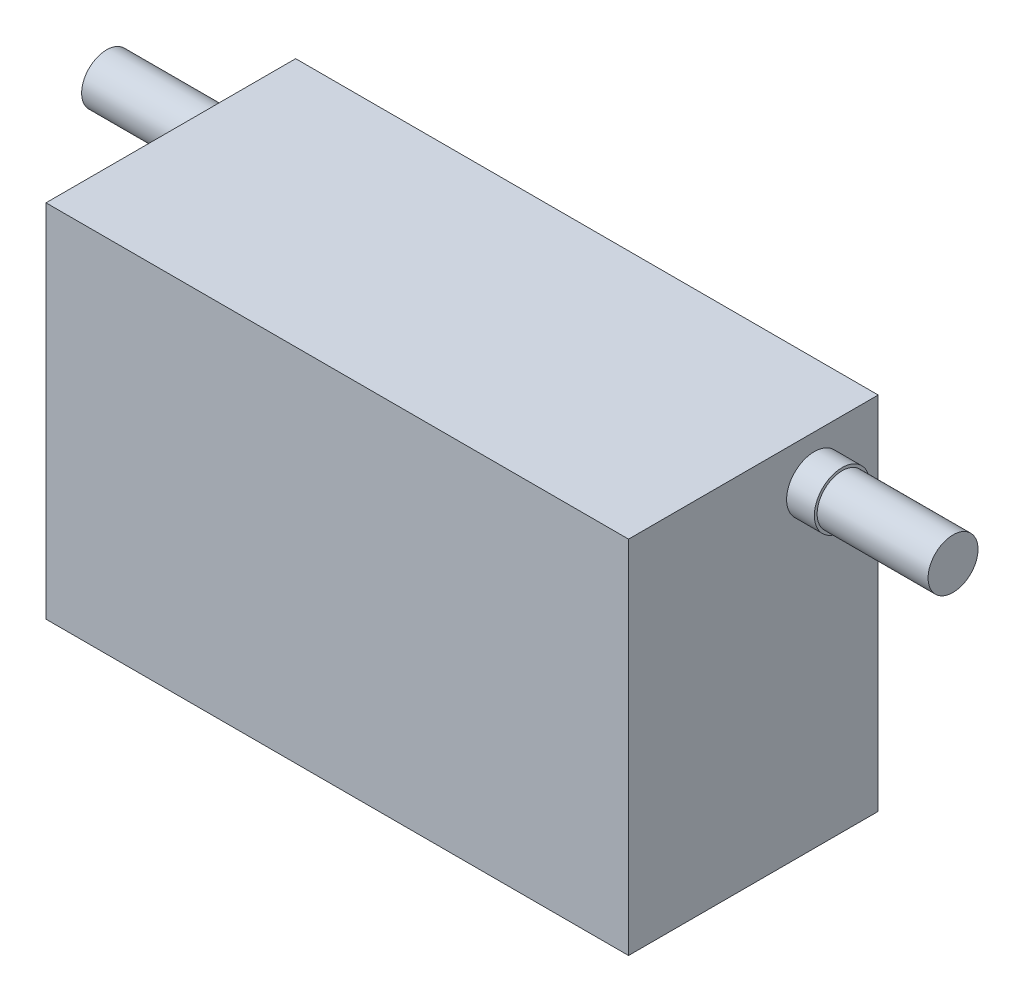
ISO-10303-21;
HEADER;
FILE_DESCRIPTION(('STEP AP214'),'2;1');
FILE_NAME('part.step','',(''),(''),'','','');
FILE_SCHEMA(('AUTOMOTIVE_DESIGN { 1 0 10303 214 1 1 1 1 }'));
ENDSEC;
DATA;
#1=APPLICATION_CONTEXT('core data for automotive mechanical design processes');
#2=APPLICATION_PROTOCOL_DEFINITION('international standard','automotive_design',2000,#1);
#3=PRODUCT_CONTEXT('',#1,'mechanical');
#4=PRODUCT('Part','Part','',(#3));
#5=PRODUCT_RELATED_PRODUCT_CATEGORY('part','',(#4));
#6=PRODUCT_DEFINITION_FORMATION('','',#4);
#7=PRODUCT_DEFINITION_CONTEXT('part definition',#1,'design');
#8=PRODUCT_DEFINITION('design','',#6,#7);
#9=PRODUCT_DEFINITION_SHAPE('','',#8);
#10=(LENGTH_UNIT() NAMED_UNIT(*) SI_UNIT(.MILLI.,.METRE.));
#11=(NAMED_UNIT(*) PLANE_ANGLE_UNIT() SI_UNIT($,.RADIAN.));
#12=(NAMED_UNIT(*) SI_UNIT($,.STERADIAN.) SOLID_ANGLE_UNIT());
#13=UNCERTAINTY_MEASURE_WITH_UNIT(LENGTH_MEASURE(1.E-05),#10,'distance_accuracy_value','');
#14=(GEOMETRIC_REPRESENTATION_CONTEXT(3) GLOBAL_UNCERTAINTY_ASSIGNED_CONTEXT((#13)) GLOBAL_UNIT_ASSIGNED_CONTEXT((#10,
#11,#12)) REPRESENTATION_CONTEXT('',''));
#15=CARTESIAN_POINT('',(0.,0.,0.));
#16=DIRECTION('',(0.,0.,1.));
#17=DIRECTION('',(1.,0.,0.));
#18=AXIS2_PLACEMENT_3D('',#15,#16,#17);
#19=CARTESIAN_POINT('',(-52.5,-32.5,45.));
#20=DIRECTION('',(1.,0.,0.));
#21=DIRECTION('',(0.,0.,-1.));
#22=AXIS2_PLACEMENT_3D('',#19,#20,#21);
#23=PLANE('',#22);
#24=CARTESIAN_POINT('',(-52.5,21.4211328330691,9.08049180265635));
#25=DIRECTION('',(1.,0.,0.));
#26=DIRECTION('',(0.,0.,-1.));
#27=AXIS2_PLACEMENT_3D('',#24,#25,#26);
#28=CIRCLE('',#27,5.);
#29=CARTESIAN_POINT('',(-52.5,21.4211328330691,4.08049180265635));
#30=VERTEX_POINT('',#29);
#31=EDGE_CURVE('E43',#30,#30,#28,.F.);
#32=ORIENTED_EDGE('',*,*,#31,.F.);
#33=EDGE_LOOP('',(#32));
#34=FACE_BOUND('',#33,.T.);
#35=DIRECTION('',(0.,-1.,0.));
#36=VECTOR('',#35,1.);
#37=CARTESIAN_POINT('',(-52.5,-32.5,0.));
#38=LINE('',#37,#36);
#39=CARTESIAN_POINT('',(-52.5,32.5,0.));
#40=VERTEX_POINT('',#39);
#41=CARTESIAN_POINT('',(-52.5,-32.5,0.));
#42=VERTEX_POINT('',#41);
#43=EDGE_CURVE('E102',#40,#42,#38,.T.);
#44=ORIENTED_EDGE('',*,*,#43,.T.);
#45=DIRECTION('',(0.,0.,-1.));
#46=VECTOR('',#45,1.);
#47=CARTESIAN_POINT('',(-52.5,-32.5,45.));
#48=LINE('',#47,#46);
#49=CARTESIAN_POINT('',(-52.5,-32.5,45.));
#50=VERTEX_POINT('',#49);
#51=EDGE_CURVE('E93',#50,#42,#48,.T.);
#52=ORIENTED_EDGE('',*,*,#51,.F.);
#53=DIRECTION('',(0.,-1.,0.));
#54=VECTOR('',#53,1.);
#55=CARTESIAN_POINT('',(-52.5,-32.5,45.));
#56=LINE('',#55,#54);
#57=CARTESIAN_POINT('',(-52.5,32.5,45.));
#58=VERTEX_POINT('',#57);
#59=EDGE_CURVE('E87',#58,#50,#56,.T.);
#60=ORIENTED_EDGE('',*,*,#59,.F.);
#61=DIRECTION('',(0.,0.,-1.));
#62=VECTOR('',#61,1.);
#63=CARTESIAN_POINT('',(-52.5,32.5,45.));
#64=LINE('',#63,#62);
#65=EDGE_CURVE('E98',#58,#40,#64,.T.);
#66=ORIENTED_EDGE('',*,*,#65,.T.);
#67=EDGE_LOOP('',(#44,#52,#60,#66));
#68=FACE_BOUND('',#67,.T.);
#69=ADVANCED_FACE('F35',(#34,#68),#23,.F.);
#70=CARTESIAN_POINT('',(52.5,-32.5,45.));
#71=DIRECTION('',(0.,1.,0.));
#72=DIRECTION('',(-1.,0.,0.));
#73=AXIS2_PLACEMENT_3D('',#70,#71,#72);
#74=PLANE('',#73);
#75=DIRECTION('',(1.,0.,0.));
#76=VECTOR('',#75,1.);
#77=CARTESIAN_POINT('',(52.5,-32.5,0.));
#78=LINE('',#77,#76);
#79=CARTESIAN_POINT('',(52.5,-32.5,0.));
#80=VERTEX_POINT('',#79);
#81=EDGE_CURVE('E92',#42,#80,#78,.T.);
#82=ORIENTED_EDGE('',*,*,#81,.T.);
#83=DIRECTION('',(0.,0.,-1.));
#84=VECTOR('',#83,1.);
#85=CARTESIAN_POINT('',(52.5,-32.5,45.));
#86=LINE('',#85,#84);
#87=CARTESIAN_POINT('',(52.5,-32.5,45.));
#88=VERTEX_POINT('',#87);
#89=EDGE_CURVE('E90',#88,#80,#86,.T.);
#90=ORIENTED_EDGE('',*,*,#89,.F.);
#91=DIRECTION('',(1.,0.,0.));
#92=VECTOR('',#91,1.);
#93=CARTESIAN_POINT('',(52.5,-32.5,45.));
#94=LINE('',#93,#92);
#95=EDGE_CURVE('E82',#50,#88,#94,.T.);
#96=ORIENTED_EDGE('',*,*,#95,.F.);
#97=ORIENTED_EDGE('',*,*,#51,.T.);
#98=EDGE_LOOP('',(#82,#90,#96,#97));
#99=FACE_BOUND('',#98,.T.);
#100=ADVANCED_FACE('F91',(#99),#74,.F.);
#101=CARTESIAN_POINT('',(52.5,-32.5,45.));
#102=DIRECTION('',(-1.,0.,0.));
#103=DIRECTION('',(0.,0.,1.));
#104=AXIS2_PLACEMENT_3D('',#101,#102,#103);
#105=PLANE('',#104);
#106=CARTESIAN_POINT('',(52.5,24.4235906945924,11.5131328497284));
#107=DIRECTION('',(-1.,0.,0.));
#108=DIRECTION('',(0.,0.,1.));
#109=AXIS2_PLACEMENT_3D('',#106,#107,#108);
#110=CIRCLE('',#109,5.);
#111=CARTESIAN_POINT('',(52.5,24.4235906945924,16.5131328497284));
#112=VERTEX_POINT('',#111);
#113=EDGE_CURVE('E11',#112,#112,#110,.F.);
#114=ORIENTED_EDGE('',*,*,#113,.F.);
#115=EDGE_LOOP('',(#114));
#116=FACE_BOUND('',#115,.T.);
#117=DIRECTION('',(0.,1.,0.));
#118=VECTOR('',#117,1.);
#119=CARTESIAN_POINT('',(52.5,-32.5,0.));
#120=LINE('',#119,#118);
#121=CARTESIAN_POINT('',(52.5,32.5,0.));
#122=VERTEX_POINT('',#121);
#123=EDGE_CURVE('E68',#80,#122,#120,.T.);
#124=ORIENTED_EDGE('',*,*,#123,.T.);
#125=DIRECTION('',(0.,0.,-1.));
#126=VECTOR('',#125,1.);
#127=CARTESIAN_POINT('',(52.5,32.5,45.));
#128=LINE('',#127,#126);
#129=CARTESIAN_POINT('',(52.5,32.5,45.));
#130=VERTEX_POINT('',#129);
#131=EDGE_CURVE('E94',#130,#122,#128,.T.);
#132=ORIENTED_EDGE('',*,*,#131,.F.);
#133=DIRECTION('',(0.,1.,0.));
#134=VECTOR('',#133,1.);
#135=CARTESIAN_POINT('',(52.5,-32.5,45.));
#136=LINE('',#135,#134);
#137=EDGE_CURVE('E85',#88,#130,#136,.T.);
#138=ORIENTED_EDGE('',*,*,#137,.F.);
#139=ORIENTED_EDGE('',*,*,#89,.T.);
#140=EDGE_LOOP('',(#124,#132,#138,#139));
#141=FACE_BOUND('',#140,.T.);
#142=ADVANCED_FACE('F96',(#116,#141),#105,.F.);
#143=CARTESIAN_POINT('',(52.5,32.5,45.));
#144=DIRECTION('',(0.,-1.,0.));
#145=DIRECTION('',(1.,0.,0.));
#146=AXIS2_PLACEMENT_3D('',#143,#144,#145);
#147=PLANE('',#146);
#148=DIRECTION('',(-1.,0.,0.));
#149=VECTOR('',#148,1.);
#150=CARTESIAN_POINT('',(52.5,32.5,0.));
#151=LINE('',#150,#149);
#152=EDGE_CURVE('E74',#122,#40,#151,.T.);
#153=ORIENTED_EDGE('',*,*,#152,.T.);
#154=ORIENTED_EDGE('',*,*,#65,.F.);
#155=DIRECTION('',(-1.,0.,0.));
#156=VECTOR('',#155,1.);
#157=CARTESIAN_POINT('',(52.5,32.5,45.));
#158=LINE('',#157,#156);
#159=EDGE_CURVE('E51',#130,#58,#158,.T.);
#160=ORIENTED_EDGE('',*,*,#159,.F.);
#161=ORIENTED_EDGE('',*,*,#131,.T.);
#162=EDGE_LOOP('',(#153,#154,#160,#161));
#163=FACE_BOUND('',#162,.T.);
#164=ADVANCED_FACE('F130',(#163),#147,.F.);
#165=CARTESIAN_POINT('',(0.,0.,45.));
#166=DIRECTION('',(0.,0.,1.));
#167=DIRECTION('',(1.,0.,0.));
#168=AXIS2_PLACEMENT_3D('',#165,#166,#167);
#169=PLANE('',#168);
#170=ORIENTED_EDGE('',*,*,#59,.T.);
#171=ORIENTED_EDGE('',*,*,#95,.T.);
#172=ORIENTED_EDGE('',*,*,#137,.T.);
#173=ORIENTED_EDGE('',*,*,#159,.T.);
#174=EDGE_LOOP('',(#170,#171,#172,#173));
#175=FACE_BOUND('',#174,.T.);
#176=ADVANCED_FACE('F83',(#175),#169,.T.);
#177=CARTESIAN_POINT('',(0.,0.,0.));
#178=DIRECTION('',(0.,0.,1.));
#179=DIRECTION('',(1.,0.,0.));
#180=AXIS2_PLACEMENT_3D('',#177,#178,#179);
#181=PLANE('',#180);
#182=ORIENTED_EDGE('',*,*,#43,.F.);
#183=ORIENTED_EDGE('',*,*,#152,.F.);
#184=ORIENTED_EDGE('',*,*,#123,.F.);
#185=ORIENTED_EDGE('',*,*,#81,.F.);
#186=EDGE_LOOP('',(#182,#183,#184,#185));
#187=FACE_BOUND('',#186,.T.);
#188=ADVANCED_FACE('F120',(#187),#181,.F.);
#189=CARTESIAN_POINT('',(-57.5,21.4211328330691,9.08049180265635));
#190=DIRECTION('',(1.,0.,0.));
#191=DIRECTION('',(0.,0.,-1.));
#192=AXIS2_PLACEMENT_3D('',#189,#190,#191);
#193=CYLINDRICAL_SURFACE('',#192,5.);
#194=CARTESIAN_POINT('',(-57.5,21.4211328330691,9.08049180265635));
#195=DIRECTION('',(-1.,0.,0.));
#196=DIRECTION('',(0.,0.,1.));
#197=AXIS2_PLACEMENT_3D('',#194,#195,#196);
#198=CIRCLE('',#197,5.);
#199=CARTESIAN_POINT('',(-57.5,21.4211328330691,14.0804918026564));
#200=VERTEX_POINT('',#199);
#201=EDGE_CURVE('E105',#200,#200,#198,.T.);
#202=ORIENTED_EDGE('',*,*,#201,.F.);
#203=EDGE_LOOP('',(#202));
#204=FACE_BOUND('',#203,.T.);
#205=ORIENTED_EDGE('',*,*,#31,.T.);
#206=EDGE_LOOP('',(#205));
#207=FACE_BOUND('',#206,.T.);
#208=ADVANCED_FACE('F114',(#204,#207),#193,.T.);
#209=CARTESIAN_POINT('',(-57.5,21.4211328330691,9.08049180265635));
#210=DIRECTION('',(-1.,0.,0.));
#211=DIRECTION('',(0.,0.,1.));
#212=AXIS2_PLACEMENT_3D('',#209,#210,#211);
#213=PLANE('',#212);
#214=CARTESIAN_POINT('',(-57.5,21.4211328330691,9.08049180265635));
#215=DIRECTION('',(-1.,0.,0.));
#216=DIRECTION('',(0.,0.,1.));
#217=AXIS2_PLACEMENT_3D('',#214,#215,#216);
#218=CIRCLE('',#217,4.5);
#219=CARTESIAN_POINT('',(-57.5,21.4211328330691,13.5804918026564));
#220=VERTEX_POINT('',#219);
#221=EDGE_CURVE('E248',#220,#220,#218,.T.);
#222=ORIENTED_EDGE('',*,*,#221,.F.);
#223=EDGE_LOOP('',(#222));
#224=FACE_BOUND('',#223,.T.);
#225=ORIENTED_EDGE('',*,*,#201,.T.);
#226=EDGE_LOOP('',(#225));
#227=FACE_BOUND('',#226,.T.);
#228=ADVANCED_FACE('F127',(#224,#227),#213,.T.);
#229=CARTESIAN_POINT('',(-77.5,21.4211328330691,9.08049180265635));
#230=DIRECTION('',(1.,0.,0.));
#231=DIRECTION('',(0.,0.,-1.));
#232=AXIS2_PLACEMENT_3D('',#229,#230,#231);
#233=CYLINDRICAL_SURFACE('',#232,4.5);
#234=CARTESIAN_POINT('',(-77.5,21.4211328330691,9.08049180265635));
#235=DIRECTION('',(-1.,0.,0.));
#236=DIRECTION('',(0.,0.,1.));
#237=AXIS2_PLACEMENT_3D('',#234,#235,#236);
#238=CIRCLE('',#237,4.5);
#239=CARTESIAN_POINT('',(-77.5,21.4211328330691,13.5804918026564));
#240=VERTEX_POINT('',#239);
#241=EDGE_CURVE('E253',#240,#240,#238,.T.);
#242=ORIENTED_EDGE('',*,*,#241,.F.);
#243=EDGE_LOOP('',(#242));
#244=FACE_BOUND('',#243,.T.);
#245=ORIENTED_EDGE('',*,*,#221,.T.);
#246=EDGE_LOOP('',(#245));
#247=FACE_BOUND('',#246,.T.);
#248=ADVANCED_FACE('F179',(#244,#247),#233,.T.);
#249=CARTESIAN_POINT('',(-77.5,21.4211328330691,9.08049180265635));
#250=DIRECTION('',(-1.,0.,0.));
#251=DIRECTION('',(0.,0.,1.));
#252=AXIS2_PLACEMENT_3D('',#249,#250,#251);
#253=PLANE('',#252);
#254=ORIENTED_EDGE('',*,*,#241,.T.);
#255=EDGE_LOOP('',(#254));
#256=FACE_BOUND('',#255,.T.);
#257=ADVANCED_FACE('F188',(#256),#253,.T.);
#258=CARTESIAN_POINT('',(57.5,24.4235906945924,11.5131328497284));
#259=DIRECTION('',(-1.,0.,0.));
#260=DIRECTION('',(0.,0.,1.));
#261=AXIS2_PLACEMENT_3D('',#258,#259,#260);
#262=CYLINDRICAL_SURFACE('',#261,5.);
#263=CARTESIAN_POINT('',(57.5,24.4235906945924,11.5131328497284));
#264=DIRECTION('',(1.,0.,0.));
#265=DIRECTION('',(0.,0.,-1.));
#266=AXIS2_PLACEMENT_3D('',#263,#264,#265);
#267=CIRCLE('',#266,5.);
#268=CARTESIAN_POINT('',(57.5,24.4235906945924,6.51313284972843));
#269=VERTEX_POINT('',#268);
#270=EDGE_CURVE('E244',#269,#269,#267,.T.);
#271=ORIENTED_EDGE('',*,*,#270,.F.);
#272=EDGE_LOOP('',(#271));
#273=FACE_BOUND('',#272,.T.);
#274=ORIENTED_EDGE('',*,*,#113,.T.);
#275=EDGE_LOOP('',(#274));
#276=FACE_BOUND('',#275,.T.);
#277=ADVANCED_FACE('F197',(#273,#276),#262,.T.);
#278=CARTESIAN_POINT('',(57.5,24.4235906945924,11.5131328497284));
#279=DIRECTION('',(1.,0.,0.));
#280=DIRECTION('',(0.,0.,-1.));
#281=AXIS2_PLACEMENT_3D('',#278,#279,#280);
#282=PLANE('',#281);
#283=CARTESIAN_POINT('',(57.5,24.4235906945924,11.5131328497284));
#284=DIRECTION('',(1.,0.,0.));
#285=DIRECTION('',(0.,0.,-1.));
#286=AXIS2_PLACEMENT_3D('',#283,#284,#285);
#287=CIRCLE('',#286,4.5);
#288=CARTESIAN_POINT('',(57.5,24.4235906945924,7.01313284972844));
#289=VERTEX_POINT('',#288);
#290=EDGE_CURVE('E245',#289,#289,#287,.T.);
#291=ORIENTED_EDGE('',*,*,#290,.F.);
#292=EDGE_LOOP('',(#291));
#293=FACE_BOUND('',#292,.T.);
#294=ORIENTED_EDGE('',*,*,#270,.T.);
#295=EDGE_LOOP('',(#294));
#296=FACE_BOUND('',#295,.T.);
#297=ADVANCED_FACE('F207',(#293,#296),#282,.T.);
#298=CARTESIAN_POINT('',(77.5,24.4235906945924,11.5131328497284));
#299=DIRECTION('',(-1.,0.,0.));
#300=DIRECTION('',(0.,0.,1.));
#301=AXIS2_PLACEMENT_3D('',#298,#299,#300);
#302=CYLINDRICAL_SURFACE('',#301,4.5);
#303=CARTESIAN_POINT('',(77.5,24.4235906945924,11.5131328497284));
#304=DIRECTION('',(1.,0.,0.));
#305=DIRECTION('',(0.,0.,-1.));
#306=AXIS2_PLACEMENT_3D('',#303,#304,#305);
#307=CIRCLE('',#306,4.5);
#308=CARTESIAN_POINT('',(77.5,24.4235906945924,7.01313284972844));
#309=VERTEX_POINT('',#308);
#310=EDGE_CURVE('E243',#309,#309,#307,.T.);
#311=ORIENTED_EDGE('',*,*,#310,.F.);
#312=EDGE_LOOP('',(#311));
#313=FACE_BOUND('',#312,.T.);
#314=ORIENTED_EDGE('',*,*,#290,.T.);
#315=EDGE_LOOP('',(#314));
#316=FACE_BOUND('',#315,.T.);
#317=ADVANCED_FACE('F214',(#313,#316),#302,.T.);
#318=CARTESIAN_POINT('',(77.5,24.4235906945924,11.5131328497284));
#319=DIRECTION('',(1.,0.,0.));
#320=DIRECTION('',(0.,0.,-1.));
#321=AXIS2_PLACEMENT_3D('',#318,#319,#320);
#322=PLANE('',#321);
#323=ORIENTED_EDGE('',*,*,#310,.T.);
#324=EDGE_LOOP('',(#323));
#325=FACE_BOUND('',#324,.T.);
#326=ADVANCED_FACE('F222',(#325),#322,.T.);
#327=CLOSED_SHELL('',(#69,#100,#142,#164,#176,#188,#208,#228,#248,#257,#277,#297,#317,#326));
#328=MANIFOLD_SOLID_BREP('B2',#327);
#329=ADVANCED_BREP_SHAPE_REPRESENTATION('',(#18,#328),#14);
#330=SHAPE_DEFINITION_REPRESENTATION(#9,#329);
ENDSEC;
END-ISO-10303-21;
